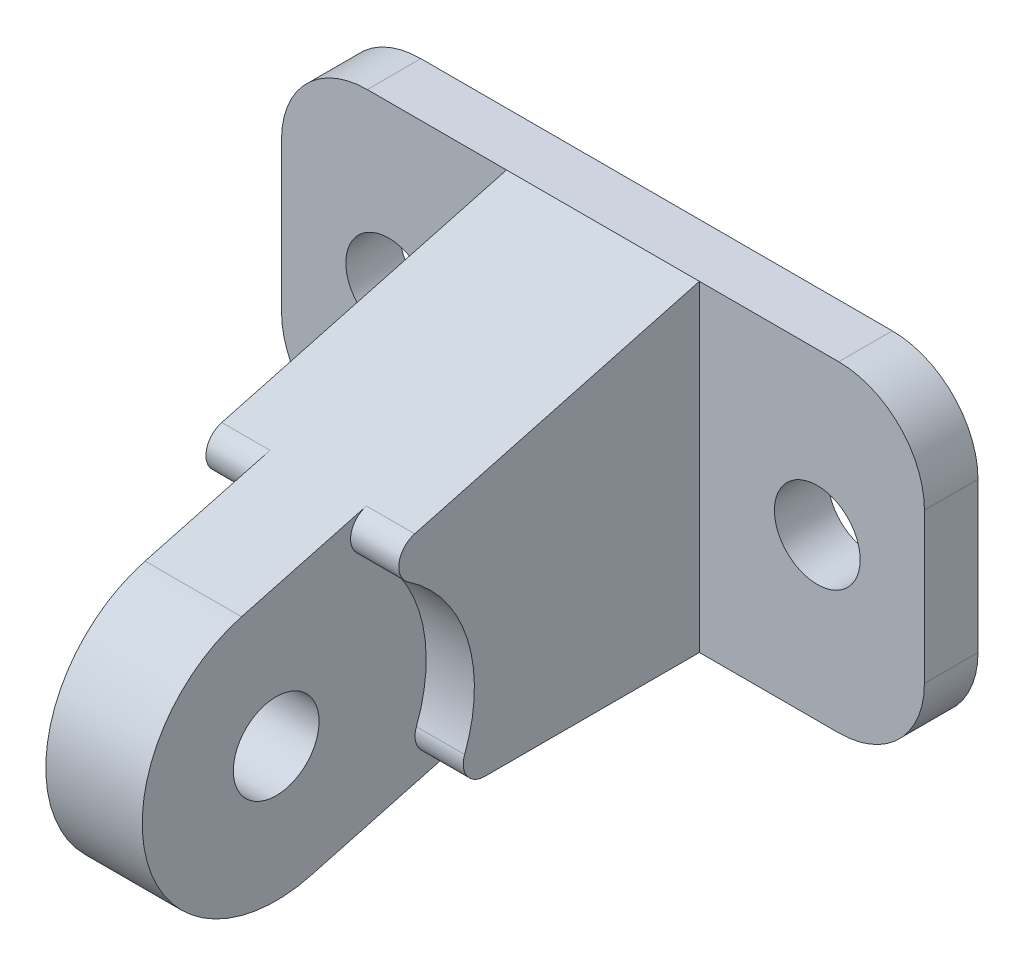
ISO-10303-21;
HEADER;
FILE_DESCRIPTION(('STEP AP214'),'2;1');
FILE_NAME('part.step','',(''),(''),'','','');
FILE_SCHEMA(('AUTOMOTIVE_DESIGN { 1 0 10303 214 1 1 1 1 }'));
ENDSEC;
DATA;
#1=APPLICATION_CONTEXT('core data for automotive mechanical design processes');
#2=APPLICATION_PROTOCOL_DEFINITION('international standard','automotive_design',2000,#1);
#3=PRODUCT_CONTEXT('',#1,'mechanical');
#4=PRODUCT('Part','Part','',(#3));
#5=PRODUCT_RELATED_PRODUCT_CATEGORY('part','',(#4));
#6=PRODUCT_DEFINITION_FORMATION('','',#4);
#7=PRODUCT_DEFINITION_CONTEXT('part definition',#1,'design');
#8=PRODUCT_DEFINITION('design','',#6,#7);
#9=PRODUCT_DEFINITION_SHAPE('','',#8);
#10=(LENGTH_UNIT() NAMED_UNIT(*) SI_UNIT(.MILLI.,.METRE.));
#11=(NAMED_UNIT(*) PLANE_ANGLE_UNIT() SI_UNIT($,.RADIAN.));
#12=(NAMED_UNIT(*) SI_UNIT($,.STERADIAN.) SOLID_ANGLE_UNIT());
#13=UNCERTAINTY_MEASURE_WITH_UNIT(LENGTH_MEASURE(1.E-05),#10,'distance_accuracy_value','');
#14=(GEOMETRIC_REPRESENTATION_CONTEXT(3) GLOBAL_UNCERTAINTY_ASSIGNED_CONTEXT((#13)) GLOBAL_UNIT_ASSIGNED_CONTEXT((#10,
#11,#12)) REPRESENTATION_CONTEXT('',''));
#15=CARTESIAN_POINT('',(0.,0.,0.));
#16=DIRECTION('',(0.,0.,1.));
#17=DIRECTION('',(1.,0.,0.));
#18=AXIS2_PLACEMENT_3D('',#15,#16,#17);
#19=CARTESIAN_POINT('',(22.,7.,4.99999999999999));
#20=DIRECTION('',(0.,0.,-1.));
#21=DIRECTION('',(-1.,0.,0.));
#22=AXIS2_PLACEMENT_3D('',#19,#20,#21);
#23=PLANE('',#22);
#24=CARTESIAN_POINT('',(-20.,0.,4.99999999999999));
#25=DIRECTION('',(0.,0.,1.));
#26=DIRECTION('',(1.,0.,0.));
#27=AXIS2_PLACEMENT_3D('',#24,#25,#26);
#28=CIRCLE('',#27,4.);
#29=CARTESIAN_POINT('',(-16.,0.,4.99999999999999));
#30=VERTEX_POINT('',#29);
#31=EDGE_CURVE('E329',#30,#30,#28,.T.);
#32=ORIENTED_EDGE('',*,*,#31,.F.);
#33=EDGE_LOOP('',(#32));
#34=FACE_BOUND('',#33,.T.);
#35=DIRECTION('',(0.,-1.,0.));
#36=VECTOR('',#35,1.);
#37=CARTESIAN_POINT('',(-9.,0.,4.99999999999999));
#38=LINE('',#37,#36);
#39=CARTESIAN_POINT('',(-9.,15.,4.99999999999999));
#40=VERTEX_POINT('',#39);
#41=CARTESIAN_POINT('',(-9.,-15.,4.99999999999999));
#42=VERTEX_POINT('',#41);
#43=EDGE_CURVE('E69',#40,#42,#38,.T.);
#44=ORIENTED_EDGE('',*,*,#43,.F.);
#45=DIRECTION('',(-1.,0.,0.));
#46=VECTOR('',#45,1.);
#47=CARTESIAN_POINT('',(-22.,15.,4.99999999999999));
#48=LINE('',#47,#46);
#49=CARTESIAN_POINT('',(-22.,15.,4.99999999999999));
#50=VERTEX_POINT('',#49);
#51=EDGE_CURVE('E341',#40,#50,#48,.T.);
#52=ORIENTED_EDGE('',*,*,#51,.T.);
#53=CARTESIAN_POINT('',(-22.,7.,4.99999999999999));
#54=DIRECTION('',(0.,0.,1.));
#55=DIRECTION('',(1.,0.,0.));
#56=AXIS2_PLACEMENT_3D('',#53,#54,#55);
#57=CIRCLE('',#56,8.);
#58=CARTESIAN_POINT('',(-30.,6.99999999999995,4.99999999999999));
#59=VERTEX_POINT('',#58);
#60=EDGE_CURVE('E346',#50,#59,#57,.T.);
#61=ORIENTED_EDGE('',*,*,#60,.T.);
#62=DIRECTION('',(0.,-1.,0.));
#63=VECTOR('',#62,1.);
#64=CARTESIAN_POINT('',(-30.,6.99999999999995,4.99999999999999));
#65=LINE('',#64,#63);
#66=CARTESIAN_POINT('',(-30.,-6.99999999999994,4.99999999999999));
#67=VERTEX_POINT('',#66);
#68=EDGE_CURVE('E349',#59,#67,#65,.T.);
#69=ORIENTED_EDGE('',*,*,#68,.T.);
#70=CARTESIAN_POINT('',(-22.,-7.,4.99999999999999));
#71=DIRECTION('',(0.,0.,1.));
#72=DIRECTION('',(1.,0.,0.));
#73=AXIS2_PLACEMENT_3D('',#70,#71,#72);
#74=CIRCLE('',#73,8.);
#75=CARTESIAN_POINT('',(-21.9999999999999,-15.,4.99999999999999));
#76=VERTEX_POINT('',#75);
#77=EDGE_CURVE('E352',#67,#76,#74,.T.);
#78=ORIENTED_EDGE('',*,*,#77,.T.);
#79=DIRECTION('',(1.,0.,0.));
#80=VECTOR('',#79,1.);
#81=CARTESIAN_POINT('',(-21.9999999999999,-15.,4.99999999999999));
#82=LINE('',#81,#80);
#83=EDGE_CURVE('E356',#76,#42,#82,.T.);
#84=ORIENTED_EDGE('',*,*,#83,.T.);
#85=EDGE_LOOP('',(#44,#52,#61,#69,#78,#84));
#86=FACE_BOUND('',#85,.T.);
#87=ADVANCED_FACE('F45',(#34,#86),#23,.F.);
#88=CARTESIAN_POINT('',(-4.5,-19.3932468188287,36.7647619362185));
#89=DIRECTION('',(0.,-0.965925826289068,-0.258819045102522));
#90=DIRECTION('',(0.,0.258819045102522,-0.965925826289068));
#91=AXIS2_PLACEMENT_3D('',#88,#89,#90);
#92=PLANE('',#91);
#93=DIRECTION('',(0.,0.258819045102522,-0.965925826289068));
#94=VECTOR('',#93,1.);
#95=CARTESIAN_POINT('',(-4.5,-19.3932468188287,36.7647619362185));
#96=LINE('',#95,#94);
#97=CARTESIAN_POINT('',(-4.5,-19.3932468188287,36.7647619362185));
#98=VERTEX_POINT('',#97);
#99=CARTESIAN_POINT('',(-4.5,-15.,20.3689415981594));
#100=VERTEX_POINT('',#99);
#101=EDGE_CURVE('E309',#98,#100,#96,.T.);
#102=ORIENTED_EDGE('',*,*,#101,.T.);
#103=DIRECTION('',(1.,0.,0.));
#104=VECTOR('',#103,1.);
#105=CARTESIAN_POINT('',(-4.5,-15.,20.3689415981594));
#106=LINE('',#105,#104);
#107=CARTESIAN_POINT('',(4.5,-15.,20.3689415981594));
#108=VERTEX_POINT('',#107);
#109=EDGE_CURVE('E268',#100,#108,#106,.T.);
#110=ORIENTED_EDGE('',*,*,#109,.T.);
#111=DIRECTION('',(0.,0.258819045102522,-0.965925826289068));
#112=VECTOR('',#111,1.);
#113=CARTESIAN_POINT('',(4.5,-19.3932468188287,36.7647619362185));
#114=LINE('',#113,#112);
#115=CARTESIAN_POINT('',(4.5,-19.3932468188287,36.7647619362185));
#116=VERTEX_POINT('',#115);
#117=EDGE_CURVE('E294',#116,#108,#114,.T.);
#118=ORIENTED_EDGE('',*,*,#117,.F.);
#119=DIRECTION('',(1.,0.,0.));
#120=VECTOR('',#119,1.);
#121=CARTESIAN_POINT('',(-4.5,-19.3932468188287,36.7647619362185));
#122=LINE('',#121,#120);
#123=EDGE_CURVE('E314',#98,#116,#122,.T.);
#124=ORIENTED_EDGE('',*,*,#123,.F.);
#125=EDGE_LOOP('',(#102,#110,#118,#124));
#126=FACE_BOUND('',#125,.T.);
#127=ADVANCED_FACE('F494',(#126),#92,.T.);
#128=CARTESIAN_POINT('',(-4.5,-7.31917399021537,40.));
#129=DIRECTION('',(1.,0.,0.));
#130=DIRECTION('',(0.,0.,-1.));
#131=AXIS2_PLACEMENT_3D('',#128,#129,#130);
#132=PLANE('',#131);
#133=CARTESIAN_POINT('',(-4.5,-7.31917399021537,40.));
#134=DIRECTION('',(1.,0.,0.));
#135=DIRECTION('',(0.,0.,-1.));
#136=AXIS2_PLACEMENT_3D('',#133,#134,#135);
#137=CIRCLE('',#136,4.);
#138=CARTESIAN_POINT('',(-4.5,-7.31917399021537,36.));
#139=VERTEX_POINT('',#138);
#140=EDGE_CURVE('E298',#139,#139,#137,.T.);
#141=ORIENTED_EDGE('',*,*,#140,.T.);
#142=EDGE_LOOP('',(#141));
#143=FACE_BOUND('',#142,.T.);
#144=CARTESIAN_POINT('',(-4.5,5.94769095738949,31.0562706625249));
#145=DIRECTION('',(1.,0.,0.));
#146=DIRECTION('',(0.,0.,-1.));
#147=AXIS2_PLACEMENT_3D('',#144,#145,#146);
#148=CIRCLE('',#147,2.);
#149=CARTESIAN_POINT('',(-4.5,4.28933283893888,32.1742368297093));
#150=VERTEX_POINT('',#149);
#151=CARTESIAN_POINT('',(-4.5,7.87954260996766,31.5739087527299));
#152=VERTEX_POINT('',#151);
#153=EDGE_CURVE('E275',#150,#152,#148,.F.);
#154=ORIENTED_EDGE('',*,*,#153,.F.);
#155=CARTESIAN_POINT('',(-4.5,-7.31917399021537,40.));
#156=DIRECTION('',(1.,0.,0.));
#157=DIRECTION('',(0.,0.,-1.));
#158=AXIS2_PLACEMENT_3D('',#155,#156,#157);
#159=CIRCLE('',#158,14.);
#160=CARTESIAN_POINT('',(-4.5,-12.2898967487769,26.9121462700136));
#161=VERTEX_POINT('',#160);
#162=EDGE_CURVE('E279',#161,#150,#159,.T.);
#163=ORIENTED_EDGE('',*,*,#162,.F.);
#164=CARTESIAN_POINT('',(-4.5,-13.,25.0424528800156));
#165=DIRECTION('',(1.,0.,0.));
#166=DIRECTION('',(0.,0.,-1.));
#167=AXIS2_PLACEMENT_3D('',#164,#165,#166);
#168=CIRCLE('',#167,2.);
#169=CARTESIAN_POINT('',(-4.5,-15.,25.0424528800156));
#170=VERTEX_POINT('',#169);
#171=EDGE_CURVE('E253',#161,#170,#168,.T.);
#172=ORIENTED_EDGE('',*,*,#171,.T.);
#173=DIRECTION('',(0.,0.,1.));
#174=VECTOR('',#173,1.);
#175=CARTESIAN_POINT('',(-4.5,-15.,40.));
#176=LINE('',#175,#174);
#177=EDGE_CURVE('E271',#100,#170,#176,.T.);
#178=ORIENTED_EDGE('',*,*,#177,.F.);
#179=ORIENTED_EDGE('',*,*,#101,.F.);
#180=CARTESIAN_POINT('',(-4.5,-7.31917399021537,40.));
#181=DIRECTION('',(1.,0.,0.));
#182=DIRECTION('',(0.,0.,-1.));
#183=AXIS2_PLACEMENT_3D('',#180,#181,#182);
#184=CIRCLE('',#183,12.5);
#185=CARTESIAN_POINT('',(-4.5,4.75489883839799,43.2352380637815));
#186=VERTEX_POINT('',#185);
#187=EDGE_CURVE('E305',#186,#98,#184,.T.);
#188=ORIENTED_EDGE('',*,*,#187,.F.);
#189=DIRECTION('',(0.,-0.258819045102521,0.965925826289068));
#190=VECTOR('',#189,1.);
#191=CARTESIAN_POINT('',(-4.5,15.,4.99999999999999));
#192=LINE('',#191,#190);
#193=EDGE_CURVE('E302',#152,#186,#192,.T.);
#194=ORIENTED_EDGE('',*,*,#193,.F.);
#195=EDGE_LOOP('',(#154,#163,#172,#178,#179,#188,#194));
#196=FACE_BOUND('',#195,.T.);
#197=ADVANCED_FACE('F481',(#143,#196),#132,.F.);
#198=CARTESIAN_POINT('',(4.5,-7.31917399021537,40.));
#199=DIRECTION('',(1.,0.,0.));
#200=DIRECTION('',(0.,0.,-1.));
#201=AXIS2_PLACEMENT_3D('',#198,#199,#200);
#202=PLANE('',#201);
#203=CARTESIAN_POINT('',(4.5,-7.31917399021537,40.));
#204=DIRECTION('',(1.,0.,0.));
#205=DIRECTION('',(0.,0.,-1.));
#206=AXIS2_PLACEMENT_3D('',#203,#204,#205);
#207=CIRCLE('',#206,4.);
#208=CARTESIAN_POINT('',(4.5,-7.31917399021537,36.));
#209=VERTEX_POINT('',#208);
#210=EDGE_CURVE('E283',#209,#209,#207,.T.);
#211=ORIENTED_EDGE('',*,*,#210,.F.);
#212=EDGE_LOOP('',(#211));
#213=FACE_BOUND('',#212,.T.);
#214=CARTESIAN_POINT('',(4.5,-7.31917399021537,40.));
#215=DIRECTION('',(1.,0.,0.));
#216=DIRECTION('',(0.,0.,-1.));
#217=AXIS2_PLACEMENT_3D('',#214,#215,#216);
#218=CIRCLE('',#217,14.);
#219=CARTESIAN_POINT('',(4.5,-12.2898967487769,26.9121462700136));
#220=VERTEX_POINT('',#219);
#221=CARTESIAN_POINT('',(4.5,4.28933283893888,32.1742368297093));
#222=VERTEX_POINT('',#221);
#223=EDGE_CURVE('E54',#220,#222,#218,.T.);
#224=ORIENTED_EDGE('',*,*,#223,.T.);
#225=CARTESIAN_POINT('',(4.5,5.94769095738949,31.0562706625249));
#226=DIRECTION('',(1.,0.,0.));
#227=DIRECTION('',(0.,0.,-1.));
#228=AXIS2_PLACEMENT_3D('',#225,#226,#227);
#229=CIRCLE('',#228,2.);
#230=CARTESIAN_POINT('',(4.5,7.87954260996766,31.5739087527299));
#231=VERTEX_POINT('',#230);
#232=EDGE_CURVE('E11',#222,#231,#229,.F.);
#233=ORIENTED_EDGE('',*,*,#232,.T.);
#234=DIRECTION('',(0.,-0.258819045102521,0.965925826289068));
#235=VECTOR('',#234,1.);
#236=CARTESIAN_POINT('',(4.5,15.,4.99999999999999));
#237=LINE('',#236,#235);
#238=CARTESIAN_POINT('',(4.5,4.75489883839799,43.2352380637815));
#239=VERTEX_POINT('',#238);
#240=EDGE_CURVE('E287',#231,#239,#237,.T.);
#241=ORIENTED_EDGE('',*,*,#240,.T.);
#242=CARTESIAN_POINT('',(4.5,-7.31917399021537,40.));
#243=DIRECTION('',(1.,0.,0.));
#244=DIRECTION('',(0.,0.,-1.));
#245=AXIS2_PLACEMENT_3D('',#242,#243,#244);
#246=CIRCLE('',#245,12.5);
#247=EDGE_CURVE('E290',#239,#116,#246,.T.);
#248=ORIENTED_EDGE('',*,*,#247,.T.);
#249=ORIENTED_EDGE('',*,*,#117,.T.);
#250=DIRECTION('',(0.,0.,1.));
#251=VECTOR('',#250,1.);
#252=CARTESIAN_POINT('',(4.5,-15.,40.));
#253=LINE('',#252,#251);
#254=CARTESIAN_POINT('',(4.5,-15.,25.0424528800156));
#255=VERTEX_POINT('',#254);
#256=EDGE_CURVE('E423',#108,#255,#253,.T.);
#257=ORIENTED_EDGE('',*,*,#256,.T.);
#258=CARTESIAN_POINT('',(4.5,-13.,25.0424528800156));
#259=DIRECTION('',(1.,0.,0.));
#260=DIRECTION('',(0.,0.,-1.));
#261=AXIS2_PLACEMENT_3D('',#258,#259,#260);
#262=CIRCLE('',#261,2.);
#263=EDGE_CURVE('E420',#220,#255,#262,.T.);
#264=ORIENTED_EDGE('',*,*,#263,.F.);
#265=EDGE_LOOP('',(#224,#233,#241,#248,#249,#257,#264));
#266=FACE_BOUND('',#265,.T.);
#267=ADVANCED_FACE('F428',(#213,#266),#202,.T.);
#268=CARTESIAN_POINT('',(20.,0.,4.99999999999999));
#269=DIRECTION('',(0.,0.,1.));
#270=DIRECTION('',(1.,0.,0.));
#271=AXIS2_PLACEMENT_3D('',#268,#269,#270);
#272=CIRCLE('',#271,4.);
#273=CARTESIAN_POINT('',(24.,0.,4.99999999999999));
#274=VERTEX_POINT('',#273);
#275=EDGE_CURVE('E321',#274,#274,#272,.T.);
#276=ORIENTED_EDGE('',*,*,#275,.F.);
#277=EDGE_LOOP('',(#276));
#278=FACE_BOUND('',#277,.T.);
#279=CARTESIAN_POINT('',(21.9999999999999,15.,4.99999999999999));
#280=VERTEX_POINT('',#279);
#281=CARTESIAN_POINT('',(9.,15.,4.99999999999999));
#282=VERTEX_POINT('',#281);
#283=EDGE_CURVE('E343',#280,#282,#48,.T.);
#284=ORIENTED_EDGE('',*,*,#283,.T.);
#285=DIRECTION('',(0.,-1.,0.));
#286=VECTOR('',#285,1.);
#287=CARTESIAN_POINT('',(9.,0.,4.99999999999999));
#288=LINE('',#287,#286);
#289=CARTESIAN_POINT('',(9.,-15.,4.99999999999999));
#290=VERTEX_POINT('',#289);
#291=EDGE_CURVE('E222',#282,#290,#288,.T.);
#292=ORIENTED_EDGE('',*,*,#291,.T.);
#293=CARTESIAN_POINT('',(21.9999999999999,-15.,4.99999999999999));
#294=VERTEX_POINT('',#293);
#295=EDGE_CURVE('E355',#290,#294,#82,.T.);
#296=ORIENTED_EDGE('',*,*,#295,.T.);
#297=CARTESIAN_POINT('',(22.,-7.,4.99999999999999));
#298=DIRECTION('',(0.,0.,1.));
#299=DIRECTION('',(1.,0.,0.));
#300=AXIS2_PLACEMENT_3D('',#297,#298,#299);
#301=CIRCLE('',#300,8.);
#302=CARTESIAN_POINT('',(30.,-7.,4.99999999999999));
#303=VERTEX_POINT('',#302);
#304=EDGE_CURVE('E359',#294,#303,#301,.T.);
#305=ORIENTED_EDGE('',*,*,#304,.T.);
#306=DIRECTION('',(0.,1.,0.));
#307=VECTOR('',#306,1.);
#308=CARTESIAN_POINT('',(30.,6.99999999999995,4.99999999999999));
#309=LINE('',#308,#307);
#310=CARTESIAN_POINT('',(30.,6.99999999999995,4.99999999999999));
#311=VERTEX_POINT('',#310);
#312=EDGE_CURVE('E362',#303,#311,#309,.T.);
#313=ORIENTED_EDGE('',*,*,#312,.T.);
#314=CARTESIAN_POINT('',(22.,7.,4.99999999999999));
#315=DIRECTION('',(0.,0.,1.));
#316=DIRECTION('',(-1.,0.,0.));
#317=AXIS2_PLACEMENT_3D('',#314,#315,#316);
#318=CIRCLE('',#317,8.);
#319=EDGE_CURVE('E337',#311,#280,#318,.T.);
#320=ORIENTED_EDGE('',*,*,#319,.T.);
#321=EDGE_LOOP('',(#284,#292,#296,#305,#313,#320));
#322=FACE_BOUND('',#321,.T.);
#323=ADVANCED_FACE('F442',(#278,#322),#23,.F.);
#324=CARTESIAN_POINT('',(22.,7.,0.));
#325=DIRECTION('',(0.,0.,-1.));
#326=DIRECTION('',(-1.,0.,0.));
#327=AXIS2_PLACEMENT_3D('',#324,#325,#326);
#328=PLANE('',#327);
#329=CARTESIAN_POINT('',(-20.,0.,0.));
#330=DIRECTION('',(0.,0.,1.));
#331=DIRECTION('',(1.,0.,0.));
#332=AXIS2_PLACEMENT_3D('',#329,#330,#331);
#333=CIRCLE('',#332,4.);
#334=CARTESIAN_POINT('',(-16.,0.,0.));
#335=VERTEX_POINT('',#334);
#336=EDGE_CURVE('E325',#335,#335,#333,.T.);
#337=ORIENTED_EDGE('',*,*,#336,.T.);
#338=EDGE_LOOP('',(#337));
#339=FACE_BOUND('',#338,.T.);
#340=CARTESIAN_POINT('',(22.,7.,0.));
#341=DIRECTION('',(0.,0.,1.));
#342=DIRECTION('',(-1.,0.,0.));
#343=AXIS2_PLACEMENT_3D('',#340,#341,#342);
#344=CIRCLE('',#343,8.);
#345=CARTESIAN_POINT('',(30.,6.99999999999995,0.));
#346=VERTEX_POINT('',#345);
#347=CARTESIAN_POINT('',(21.9999999999999,15.,0.));
#348=VERTEX_POINT('',#347);
#349=EDGE_CURVE('E333',#346,#348,#344,.T.);
#350=ORIENTED_EDGE('',*,*,#349,.F.);
#351=DIRECTION('',(0.,1.,0.));
#352=VECTOR('',#351,1.);
#353=CARTESIAN_POINT('',(30.,6.99999999999995,0.));
#354=LINE('',#353,#352);
#355=CARTESIAN_POINT('',(30.,-7.,0.));
#356=VERTEX_POINT('',#355);
#357=EDGE_CURVE('E342',#356,#346,#354,.T.);
#358=ORIENTED_EDGE('',*,*,#357,.F.);
#359=CARTESIAN_POINT('',(22.,-7.,0.));
#360=DIRECTION('',(0.,0.,1.));
#361=DIRECTION('',(1.,0.,0.));
#362=AXIS2_PLACEMENT_3D('',#359,#360,#361);
#363=CIRCLE('',#362,8.);
#364=CARTESIAN_POINT('',(21.9999999999999,-15.,0.));
#365=VERTEX_POINT('',#364);
#366=EDGE_CURVE('E384',#365,#356,#363,.T.);
#367=ORIENTED_EDGE('',*,*,#366,.F.);
#368=DIRECTION('',(1.,0.,0.));
#369=VECTOR('',#368,1.);
#370=CARTESIAN_POINT('',(-21.9999999999999,-15.,0.));
#371=LINE('',#370,#369);
#372=CARTESIAN_POINT('',(-21.9999999999999,-15.,0.));
#373=VERTEX_POINT('',#372);
#374=EDGE_CURVE('E381',#373,#365,#371,.T.);
#375=ORIENTED_EDGE('',*,*,#374,.F.);
#376=CARTESIAN_POINT('',(-22.,-7.,0.));
#377=DIRECTION('',(0.,0.,1.));
#378=DIRECTION('',(1.,0.,0.));
#379=AXIS2_PLACEMENT_3D('',#376,#377,#378);
#380=CIRCLE('',#379,8.);
#381=CARTESIAN_POINT('',(-30.,-6.99999999999994,0.));
#382=VERTEX_POINT('',#381);
#383=EDGE_CURVE('E378',#382,#373,#380,.T.);
#384=ORIENTED_EDGE('',*,*,#383,.F.);
#385=DIRECTION('',(0.,-1.,0.));
#386=VECTOR('',#385,1.);
#387=CARTESIAN_POINT('',(-30.,6.99999999999995,0.));
#388=LINE('',#387,#386);
#389=CARTESIAN_POINT('',(-30.,6.99999999999995,0.));
#390=VERTEX_POINT('',#389);
#391=EDGE_CURVE('E375',#390,#382,#388,.T.);
#392=ORIENTED_EDGE('',*,*,#391,.F.);
#393=CARTESIAN_POINT('',(-22.,7.,0.));
#394=DIRECTION('',(0.,0.,1.));
#395=DIRECTION('',(1.,0.,0.));
#396=AXIS2_PLACEMENT_3D('',#393,#394,#395);
#397=CIRCLE('',#396,8.);
#398=CARTESIAN_POINT('',(-22.,15.,0.));
#399=VERTEX_POINT('',#398);
#400=EDGE_CURVE('E372',#399,#390,#397,.T.);
#401=ORIENTED_EDGE('',*,*,#400,.F.);
#402=DIRECTION('',(-1.,0.,0.));
#403=VECTOR('',#402,1.);
#404=CARTESIAN_POINT('',(-22.,15.,0.));
#405=LINE('',#404,#403);
#406=EDGE_CURVE('E369',#348,#399,#405,.T.);
#407=ORIENTED_EDGE('',*,*,#406,.F.);
#408=EDGE_LOOP('',(#350,#358,#367,#375,#384,#392,#401,#407));
#409=FACE_BOUND('',#408,.T.);
#410=CARTESIAN_POINT('',(20.,0.,0.));
#411=DIRECTION('',(0.,0.,1.));
#412=DIRECTION('',(1.,0.,0.));
#413=AXIS2_PLACEMENT_3D('',#410,#411,#412);
#414=CIRCLE('',#413,4.);
#415=CARTESIAN_POINT('',(24.,0.,0.));
#416=VERTEX_POINT('',#415);
#417=EDGE_CURVE('E317',#416,#416,#414,.T.);
#418=ORIENTED_EDGE('',*,*,#417,.T.);
#419=EDGE_LOOP('',(#418));
#420=FACE_BOUND('',#419,.T.);
#421=ADVANCED_FACE('F521',(#339,#409,#420),#328,.T.);
#422=CARTESIAN_POINT('',(22.,7.,4.99999999999999));
#423=DIRECTION('',(0.,0.,-1.));
#424=DIRECTION('',(-1.,0.,0.));
#425=AXIS2_PLACEMENT_3D('',#422,#423,#424);
#426=CYLINDRICAL_SURFACE('',#425,8.);
#427=ORIENTED_EDGE('',*,*,#349,.T.);
#428=DIRECTION('',(0.,0.,-1.));
#429=VECTOR('',#428,1.);
#430=CARTESIAN_POINT('',(21.9999999999999,15.,4.99999999999999));
#431=LINE('',#430,#429);
#432=EDGE_CURVE('E416',#280,#348,#431,.T.);
#433=ORIENTED_EDGE('',*,*,#432,.F.);
#434=ORIENTED_EDGE('',*,*,#319,.F.);
#435=DIRECTION('',(0.,0.,-1.));
#436=VECTOR('',#435,1.);
#437=CARTESIAN_POINT('',(30.,6.99999999999995,4.99999999999999));
#438=LINE('',#437,#436);
#439=EDGE_CURVE('E365',#311,#346,#438,.T.);
#440=ORIENTED_EDGE('',*,*,#439,.T.);
#441=EDGE_LOOP('',(#427,#433,#434,#440));
#442=FACE_BOUND('',#441,.T.);
#443=ADVANCED_FACE('F47',(#442),#426,.T.);
#444=CARTESIAN_POINT('',(-22.,15.,4.99999999999999));
#445=DIRECTION('',(0.,-1.,0.));
#446=DIRECTION('',(0.,0.,-1.));
#447=AXIS2_PLACEMENT_3D('',#444,#445,#446);
#448=PLANE('',#447);
#449=ORIENTED_EDGE('',*,*,#406,.T.);
#450=DIRECTION('',(0.,0.,-1.));
#451=VECTOR('',#450,1.);
#452=CARTESIAN_POINT('',(-22.,15.,4.99999999999999));
#453=LINE('',#452,#451);
#454=EDGE_CURVE('E412',#50,#399,#453,.T.);
#455=ORIENTED_EDGE('',*,*,#454,.F.);
#456=ORIENTED_EDGE('',*,*,#51,.F.);
#457=EDGE_CURVE('E61',#282,#40,#48,.T.);
#458=ORIENTED_EDGE('',*,*,#457,.F.);
#459=ORIENTED_EDGE('',*,*,#283,.F.);
#460=ORIENTED_EDGE('',*,*,#432,.T.);
#461=EDGE_LOOP('',(#449,#455,#456,#458,#459,#460));
#462=FACE_BOUND('',#461,.T.);
#463=ADVANCED_FACE('F453',(#462),#448,.F.);
#464=CARTESIAN_POINT('',(-22.,7.,4.99999999999999));
#465=DIRECTION('',(0.,0.,-1.));
#466=DIRECTION('',(-1.,0.,0.));
#467=AXIS2_PLACEMENT_3D('',#464,#465,#466);
#468=CYLINDRICAL_SURFACE('',#467,8.);
#469=ORIENTED_EDGE('',*,*,#400,.T.);
#470=DIRECTION('',(0.,0.,-1.));
#471=VECTOR('',#470,1.);
#472=CARTESIAN_POINT('',(-30.,6.99999999999995,4.99999999999999));
#473=LINE('',#472,#471);
#474=EDGE_CURVE('E408',#59,#390,#473,.T.);
#475=ORIENTED_EDGE('',*,*,#474,.F.);
#476=ORIENTED_EDGE('',*,*,#60,.F.);
#477=ORIENTED_EDGE('',*,*,#454,.T.);
#478=EDGE_LOOP('',(#469,#475,#476,#477));
#479=FACE_BOUND('',#478,.T.);
#480=ADVANCED_FACE('F456',(#479),#468,.T.);
#481=CARTESIAN_POINT('',(-30.,6.99999999999995,4.99999999999999));
#482=DIRECTION('',(1.,0.,0.));
#483=DIRECTION('',(0.,1.,0.));
#484=AXIS2_PLACEMENT_3D('',#481,#482,#483);
#485=PLANE('',#484);
#486=ORIENTED_EDGE('',*,*,#391,.T.);
#487=DIRECTION('',(0.,0.,-1.));
#488=VECTOR('',#487,1.);
#489=CARTESIAN_POINT('',(-30.,-6.99999999999994,4.99999999999999));
#490=LINE('',#489,#488);
#491=EDGE_CURVE('E404',#67,#382,#490,.T.);
#492=ORIENTED_EDGE('',*,*,#491,.F.);
#493=ORIENTED_EDGE('',*,*,#68,.F.);
#494=ORIENTED_EDGE('',*,*,#474,.T.);
#495=EDGE_LOOP('',(#486,#492,#493,#494));
#496=FACE_BOUND('',#495,.T.);
#497=ADVANCED_FACE('F461',(#496),#485,.F.);
#498=CARTESIAN_POINT('',(-22.,-7.,4.99999999999999));
#499=DIRECTION('',(0.,0.,-1.));
#500=DIRECTION('',(-1.,0.,0.));
#501=AXIS2_PLACEMENT_3D('',#498,#499,#500);
#502=CYLINDRICAL_SURFACE('',#501,8.);
#503=ORIENTED_EDGE('',*,*,#383,.T.);
#504=DIRECTION('',(0.,0.,-1.));
#505=VECTOR('',#504,1.);
#506=CARTESIAN_POINT('',(-21.9999999999999,-15.,4.99999999999999));
#507=LINE('',#506,#505);
#508=EDGE_CURVE('E400',#76,#373,#507,.T.);
#509=ORIENTED_EDGE('',*,*,#508,.F.);
#510=ORIENTED_EDGE('',*,*,#77,.F.);
#511=ORIENTED_EDGE('',*,*,#491,.T.);
#512=EDGE_LOOP('',(#503,#509,#510,#511));
#513=FACE_BOUND('',#512,.T.);
#514=ADVANCED_FACE('F466',(#513),#502,.T.);
#515=CARTESIAN_POINT('',(-21.9999999999999,-15.,4.99999999999999));
#516=DIRECTION('',(0.,1.,0.));
#517=DIRECTION('',(0.,0.,1.));
#518=AXIS2_PLACEMENT_3D('',#515,#516,#517);
#519=PLANE('',#518);
#520=ORIENTED_EDGE('',*,*,#374,.T.);
#521=DIRECTION('',(0.,0.,-1.));
#522=VECTOR('',#521,1.);
#523=CARTESIAN_POINT('',(21.9999999999999,-15.,4.99999999999999));
#524=LINE('',#523,#522);
#525=EDGE_CURVE('E396',#294,#365,#524,.T.);
#526=ORIENTED_EDGE('',*,*,#525,.F.);
#527=ORIENTED_EDGE('',*,*,#295,.F.);
#528=DIRECTION('',(0.,0.,1.));
#529=VECTOR('',#528,1.);
#530=CARTESIAN_POINT('',(9.,-15.,0.));
#531=LINE('',#530,#529);
#532=CARTESIAN_POINT('',(9.,-15.,25.0424528800156));
#533=VERTEX_POINT('',#532);
#534=EDGE_CURVE('E211',#290,#533,#531,.T.);
#535=ORIENTED_EDGE('',*,*,#534,.T.);
#536=DIRECTION('',(1.,0.,0.));
#537=VECTOR('',#536,1.);
#538=CARTESIAN_POINT('',(-9.,-15.,25.0424528800156));
#539=LINE('',#538,#537);
#540=EDGE_CURVE('E206',#255,#533,#539,.T.);
#541=ORIENTED_EDGE('',*,*,#540,.F.);
#542=ORIENTED_EDGE('',*,*,#256,.F.);
#543=ORIENTED_EDGE('',*,*,#109,.F.);
#544=ORIENTED_EDGE('',*,*,#177,.T.);
#545=CARTESIAN_POINT('',(-9.,-15.,25.0424528800156));
#546=VERTEX_POINT('',#545);
#547=EDGE_CURVE('E260',#546,#170,#539,.T.);
#548=ORIENTED_EDGE('',*,*,#547,.F.);
#549=DIRECTION('',(0.,0.,1.));
#550=VECTOR('',#549,1.);
#551=CARTESIAN_POINT('',(-9.,-15.,0.));
#552=LINE('',#551,#550);
#553=EDGE_CURVE('E238',#42,#546,#552,.T.);
#554=ORIENTED_EDGE('',*,*,#553,.F.);
#555=ORIENTED_EDGE('',*,*,#83,.F.);
#556=ORIENTED_EDGE('',*,*,#508,.T.);
#557=EDGE_LOOP('',(#520,#526,#527,#535,#541,#542,#543,#544,#548,#554,#555,#556));
#558=FACE_BOUND('',#557,.T.);
#559=ADVANCED_FACE('F445',(#558),#519,.F.);
#560=CARTESIAN_POINT('',(22.,-7.,4.99999999999999));
#561=DIRECTION('',(0.,0.,-1.));
#562=DIRECTION('',(-1.,0.,0.));
#563=AXIS2_PLACEMENT_3D('',#560,#561,#562);
#564=CYLINDRICAL_SURFACE('',#563,8.);
#565=ORIENTED_EDGE('',*,*,#366,.T.);
#566=DIRECTION('',(0.,0.,-1.));
#567=VECTOR('',#566,1.);
#568=CARTESIAN_POINT('',(30.,-7.,4.99999999999999));
#569=LINE('',#568,#567);
#570=EDGE_CURVE('E392',#303,#356,#569,.T.);
#571=ORIENTED_EDGE('',*,*,#570,.F.);
#572=ORIENTED_EDGE('',*,*,#304,.F.);
#573=ORIENTED_EDGE('',*,*,#525,.T.);
#574=EDGE_LOOP('',(#565,#571,#572,#573));
#575=FACE_BOUND('',#574,.T.);
#576=ADVANCED_FACE('F628',(#575),#564,.T.);
#577=CARTESIAN_POINT('',(30.,6.99999999999995,4.99999999999999));
#578=DIRECTION('',(-1.,0.,0.));
#579=DIRECTION('',(0.,-1.,0.));
#580=AXIS2_PLACEMENT_3D('',#577,#578,#579);
#581=PLANE('',#580);
#582=ORIENTED_EDGE('',*,*,#357,.T.);
#583=ORIENTED_EDGE('',*,*,#439,.F.);
#584=ORIENTED_EDGE('',*,*,#312,.F.);
#585=ORIENTED_EDGE('',*,*,#570,.T.);
#586=EDGE_LOOP('',(#582,#583,#584,#585));
#587=FACE_BOUND('',#586,.T.);
#588=ADVANCED_FACE('F693',(#587),#581,.F.);
#589=CARTESIAN_POINT('',(-20.,0.,4.99999999999999));
#590=DIRECTION('',(0.,0.,-1.));
#591=DIRECTION('',(-1.,0.,0.));
#592=AXIS2_PLACEMENT_3D('',#589,#590,#591);
#593=CYLINDRICAL_SURFACE('',#592,4.);
#594=ORIENTED_EDGE('',*,*,#31,.T.);
#595=EDGE_LOOP('',(#594));
#596=FACE_BOUND('',#595,.T.);
#597=ORIENTED_EDGE('',*,*,#336,.F.);
#598=EDGE_LOOP('',(#597));
#599=FACE_BOUND('',#598,.T.);
#600=ADVANCED_FACE('F507',(#596,#599),#593,.F.);
#601=CARTESIAN_POINT('',(20.,0.,4.99999999999999));
#602=DIRECTION('',(0.,0.,-1.));
#603=DIRECTION('',(-1.,0.,0.));
#604=AXIS2_PLACEMENT_3D('',#601,#602,#603);
#605=CYLINDRICAL_SURFACE('',#604,4.);
#606=ORIENTED_EDGE('',*,*,#275,.T.);
#607=EDGE_LOOP('',(#606));
#608=FACE_BOUND('',#607,.T.);
#609=ORIENTED_EDGE('',*,*,#417,.F.);
#610=EDGE_LOOP('',(#609));
#611=FACE_BOUND('',#610,.T.);
#612=ADVANCED_FACE('F499',(#608,#611),#605,.F.);
#613=CARTESIAN_POINT('',(-4.5,-7.31917399021537,40.));
#614=DIRECTION('',(1.,0.,0.));
#615=DIRECTION('',(0.,0.,-1.));
#616=AXIS2_PLACEMENT_3D('',#613,#614,#615);
#617=CYLINDRICAL_SURFACE('',#616,12.5);
#618=ORIENTED_EDGE('',*,*,#123,.T.);
#619=ORIENTED_EDGE('',*,*,#247,.F.);
#620=DIRECTION('',(1.,0.,0.));
#621=VECTOR('',#620,1.);
#622=CARTESIAN_POINT('',(-4.5,4.75489883839799,43.2352380637815));
#623=LINE('',#622,#621);
#624=EDGE_CURVE('E313',#186,#239,#623,.T.);
#625=ORIENTED_EDGE('',*,*,#624,.F.);
#626=ORIENTED_EDGE('',*,*,#187,.T.);
#627=EDGE_LOOP('',(#618,#619,#625,#626));
#628=FACE_BOUND('',#627,.T.);
#629=ADVANCED_FACE('F497',(#628),#617,.T.);
#630=CARTESIAN_POINT('',(-4.5,15.,4.99999999999999));
#631=DIRECTION('',(0.,0.965925826289068,0.258819045102521));
#632=DIRECTION('',(0.,-0.258819045102521,0.965925826289068));
#633=AXIS2_PLACEMENT_3D('',#630,#631,#632);
#634=PLANE('',#633);
#635=DIRECTION('',(1.,0.,0.));
#636=VECTOR('',#635,1.);
#637=CARTESIAN_POINT('',(-9.,7.87954260996763,31.5739087527299));
#638=LINE('',#637,#636);
#639=CARTESIAN_POINT('',(-9.,7.87954260996763,31.5739087527299));
#640=VERTEX_POINT('',#639);
#641=EDGE_CURVE('E255',#640,#152,#638,.T.);
#642=ORIENTED_EDGE('',*,*,#641,.T.);
#643=ORIENTED_EDGE('',*,*,#193,.T.);
#644=ORIENTED_EDGE('',*,*,#624,.T.);
#645=ORIENTED_EDGE('',*,*,#240,.F.);
#646=CARTESIAN_POINT('',(9.,7.87954260996763,31.5739087527299));
#647=VERTEX_POINT('',#646);
#648=EDGE_CURVE('E259',#231,#647,#638,.T.);
#649=ORIENTED_EDGE('',*,*,#648,.T.);
#650=DIRECTION('',(0.,-0.258819045102523,0.965925826289068));
#651=VECTOR('',#650,1.);
#652=CARTESIAN_POINT('',(9.,15.2451905283833,4.08493649053893));
#653=LINE('',#652,#651);
#654=EDGE_CURVE('E225',#282,#647,#653,.T.);
#655=ORIENTED_EDGE('',*,*,#654,.F.);
#656=ORIENTED_EDGE('',*,*,#457,.T.);
#657=DIRECTION('',(0.,-0.258819045102523,0.965925826289068));
#658=VECTOR('',#657,1.);
#659=CARTESIAN_POINT('',(-9.,15.2451905283833,4.08493649053893));
#660=LINE('',#659,#658);
#661=EDGE_CURVE('E243',#40,#640,#660,.T.);
#662=ORIENTED_EDGE('',*,*,#661,.T.);
#663=EDGE_LOOP('',(#642,#643,#644,#645,#649,#655,#656,#662));
#664=FACE_BOUND('',#663,.T.);
#665=ADVANCED_FACE('F438',(#664),#634,.T.);
#666=CARTESIAN_POINT('',(-4.5,-7.31917399021537,40.));
#667=DIRECTION('',(1.,0.,0.));
#668=DIRECTION('',(0.,0.,-1.));
#669=AXIS2_PLACEMENT_3D('',#666,#667,#668);
#670=CYLINDRICAL_SURFACE('',#669,4.);
#671=ORIENTED_EDGE('',*,*,#140,.F.);
#672=EDGE_LOOP('',(#671));
#673=FACE_BOUND('',#672,.T.);
#674=ORIENTED_EDGE('',*,*,#210,.T.);
#675=EDGE_LOOP('',(#674));
#676=FACE_BOUND('',#675,.T.);
#677=ADVANCED_FACE('F505',(#673,#676),#670,.F.);
#678=CARTESIAN_POINT('',(-9.,-7.31917399021537,40.));
#679=DIRECTION('',(1.,0.,0.));
#680=DIRECTION('',(0.,0.,-1.));
#681=AXIS2_PLACEMENT_3D('',#678,#679,#680);
#682=CYLINDRICAL_SURFACE('',#681,14.);
#683=DIRECTION('',(1.,0.,0.));
#684=VECTOR('',#683,1.);
#685=CARTESIAN_POINT('',(-9.,-12.2898967487769,26.9121462700136));
#686=LINE('',#685,#684);
#687=CARTESIAN_POINT('',(-9.,-12.2898967487769,26.9121462700136));
#688=VERTEX_POINT('',#687);
#689=EDGE_CURVE('E199',#688,#161,#686,.T.);
#690=ORIENTED_EDGE('',*,*,#689,.T.);
#691=ORIENTED_EDGE('',*,*,#162,.T.);
#692=DIRECTION('',(1.,0.,0.));
#693=VECTOR('',#692,1.);
#694=CARTESIAN_POINT('',(-9.,4.28933283893888,32.1742368297093));
#695=LINE('',#694,#693);
#696=CARTESIAN_POINT('',(-9.,4.28933283893888,32.1742368297093));
#697=VERTEX_POINT('',#696);
#698=EDGE_CURVE('E249',#697,#150,#695,.T.);
#699=ORIENTED_EDGE('',*,*,#698,.F.);
#700=CARTESIAN_POINT('',(-9.,-7.31917399021537,40.));
#701=DIRECTION('',(1.,0.,0.));
#702=DIRECTION('',(0.,0.,-1.));
#703=AXIS2_PLACEMENT_3D('',#700,#701,#702);
#704=CIRCLE('',#703,14.);
#705=EDGE_CURVE('E230',#688,#697,#704,.T.);
#706=ORIENTED_EDGE('',*,*,#705,.F.);
#707=EDGE_LOOP('',(#690,#691,#699,#706));
#708=FACE_BOUND('',#707,.T.);
#709=ADVANCED_FACE('F485',(#708),#682,.F.);
#710=CARTESIAN_POINT('',(-9.,5.94769095738949,31.0562706625249));
#711=DIRECTION('',(1.,0.,0.));
#712=DIRECTION('',(0.,0.,-1.));
#713=AXIS2_PLACEMENT_3D('',#710,#711,#712);
#714=CYLINDRICAL_SURFACE('',#713,2.);
#715=ORIENTED_EDGE('',*,*,#698,.T.);
#716=ORIENTED_EDGE('',*,*,#153,.T.);
#717=ORIENTED_EDGE('',*,*,#641,.F.);
#718=CARTESIAN_POINT('',(-9.,5.94769095738949,31.0562706625249));
#719=DIRECTION('',(1.,0.,0.));
#720=DIRECTION('',(0.,0.,-1.));
#721=AXIS2_PLACEMENT_3D('',#718,#719,#720);
#722=CIRCLE('',#721,2.);
#723=EDGE_CURVE('E200',#697,#640,#722,.F.);
#724=ORIENTED_EDGE('',*,*,#723,.F.);
#725=EDGE_LOOP('',(#715,#716,#717,#724));
#726=FACE_BOUND('',#725,.T.);
#727=ADVANCED_FACE('F478',(#726),#714,.T.);
#728=CARTESIAN_POINT('',(-9.,-13.,25.0424528800156));
#729=DIRECTION('',(1.,0.,0.));
#730=DIRECTION('',(0.,0.,-1.));
#731=AXIS2_PLACEMENT_3D('',#728,#729,#730);
#732=CYLINDRICAL_SURFACE('',#731,2.);
#733=ORIENTED_EDGE('',*,*,#171,.F.);
#734=ORIENTED_EDGE('',*,*,#689,.F.);
#735=CARTESIAN_POINT('',(-9.,-13.,25.0424528800156));
#736=DIRECTION('',(1.,0.,0.));
#737=DIRECTION('',(0.,0.,-1.));
#738=AXIS2_PLACEMENT_3D('',#735,#736,#737);
#739=CIRCLE('',#738,2.);
#740=EDGE_CURVE('E234',#688,#546,#739,.T.);
#741=ORIENTED_EDGE('',*,*,#740,.T.);
#742=ORIENTED_EDGE('',*,*,#547,.T.);
#743=EDGE_LOOP('',(#733,#734,#741,#742));
#744=FACE_BOUND('',#743,.T.);
#745=ADVANCED_FACE('F488',(#744),#732,.T.);
#746=ORIENTED_EDGE('',*,*,#223,.F.);
#747=CARTESIAN_POINT('',(9.,-12.2898967487769,26.9121462700136));
#748=VERTEX_POINT('',#747);
#749=EDGE_CURVE('E189',#220,#748,#686,.T.);
#750=ORIENTED_EDGE('',*,*,#749,.T.);
#751=CARTESIAN_POINT('',(9.,-7.31917399021537,40.));
#752=DIRECTION('',(1.,0.,0.));
#753=DIRECTION('',(0.,0.,-1.));
#754=AXIS2_PLACEMENT_3D('',#751,#752,#753);
#755=CIRCLE('',#754,14.);
#756=CARTESIAN_POINT('',(9.,4.28933283893888,32.1742368297093));
#757=VERTEX_POINT('',#756);
#758=EDGE_CURVE('E194',#748,#757,#755,.T.);
#759=ORIENTED_EDGE('',*,*,#758,.T.);
#760=EDGE_CURVE('E254',#222,#757,#695,.T.);
#761=ORIENTED_EDGE('',*,*,#760,.F.);
#762=EDGE_LOOP('',(#746,#750,#759,#761));
#763=FACE_BOUND('',#762,.T.);
#764=ADVANCED_FACE('F191',(#763),#682,.F.);
#765=ORIENTED_EDGE('',*,*,#232,.F.);
#766=ORIENTED_EDGE('',*,*,#760,.T.);
#767=CARTESIAN_POINT('',(9.,5.94769095738949,31.0562706625249));
#768=DIRECTION('',(1.,0.,0.));
#769=DIRECTION('',(0.,0.,-1.));
#770=AXIS2_PLACEMENT_3D('',#767,#768,#769);
#771=CIRCLE('',#770,2.);
#772=EDGE_CURVE('E216',#757,#647,#771,.F.);
#773=ORIENTED_EDGE('',*,*,#772,.T.);
#774=ORIENTED_EDGE('',*,*,#648,.F.);
#775=EDGE_LOOP('',(#765,#766,#773,#774));
#776=FACE_BOUND('',#775,.T.);
#777=ADVANCED_FACE('F432',(#776),#714,.T.);
#778=ORIENTED_EDGE('',*,*,#749,.F.);
#779=ORIENTED_EDGE('',*,*,#263,.T.);
#780=ORIENTED_EDGE('',*,*,#540,.T.);
#781=CARTESIAN_POINT('',(9.,-13.,25.0424528800156));
#782=DIRECTION('',(1.,0.,0.));
#783=DIRECTION('',(0.,0.,-1.));
#784=AXIS2_PLACEMENT_3D('',#781,#782,#783);
#785=CIRCLE('',#784,2.);
#786=EDGE_CURVE('E203',#748,#533,#785,.T.);
#787=ORIENTED_EDGE('',*,*,#786,.F.);
#788=EDGE_LOOP('',(#778,#779,#780,#787));
#789=FACE_BOUND('',#788,.T.);
#790=ADVANCED_FACE('F204',(#789),#732,.T.);
#791=CARTESIAN_POINT('',(-9.,0.,0.));
#792=DIRECTION('',(1.,0.,0.));
#793=DIRECTION('',(0.,0.,-1.));
#794=AXIS2_PLACEMENT_3D('',#791,#792,#793);
#795=PLANE('',#794);
#796=ORIENTED_EDGE('',*,*,#705,.T.);
#797=ORIENTED_EDGE('',*,*,#723,.T.);
#798=ORIENTED_EDGE('',*,*,#661,.F.);
#799=ORIENTED_EDGE('',*,*,#43,.T.);
#800=ORIENTED_EDGE('',*,*,#553,.T.);
#801=ORIENTED_EDGE('',*,*,#740,.F.);
#802=EDGE_LOOP('',(#796,#797,#798,#799,#800,#801));
#803=FACE_BOUND('',#802,.T.);
#804=ADVANCED_FACE('F473',(#803),#795,.F.);
#805=CARTESIAN_POINT('',(9.,0.,0.));
#806=DIRECTION('',(1.,0.,0.));
#807=DIRECTION('',(0.,0.,-1.));
#808=AXIS2_PLACEMENT_3D('',#805,#806,#807);
#809=PLANE('',#808);
#810=ORIENTED_EDGE('',*,*,#758,.F.);
#811=ORIENTED_EDGE('',*,*,#786,.T.);
#812=ORIENTED_EDGE('',*,*,#534,.F.);
#813=ORIENTED_EDGE('',*,*,#291,.F.);
#814=ORIENTED_EDGE('',*,*,#654,.T.);
#815=ORIENTED_EDGE('',*,*,#772,.F.);
#816=EDGE_LOOP('',(#810,#811,#812,#813,#814,#815));
#817=FACE_BOUND('',#816,.T.);
#818=ADVANCED_FACE('F213',(#817),#809,.T.);
#819=CLOSED_SHELL('',(#87,#127,#197,#267,#323,#421,#443,#463,#480,#497,#514,#559,#576,#588,#600,
#612,#629,#665,#677,#709,#727,#745,#764,#777,#790,#804,#818));
#820=MANIFOLD_SOLID_BREP('B2',#819);
#821=ADVANCED_BREP_SHAPE_REPRESENTATION('',(#18,#820),#14);
#822=SHAPE_DEFINITION_REPRESENTATION(#9,#821);
ENDSEC;
END-ISO-10303-21;
